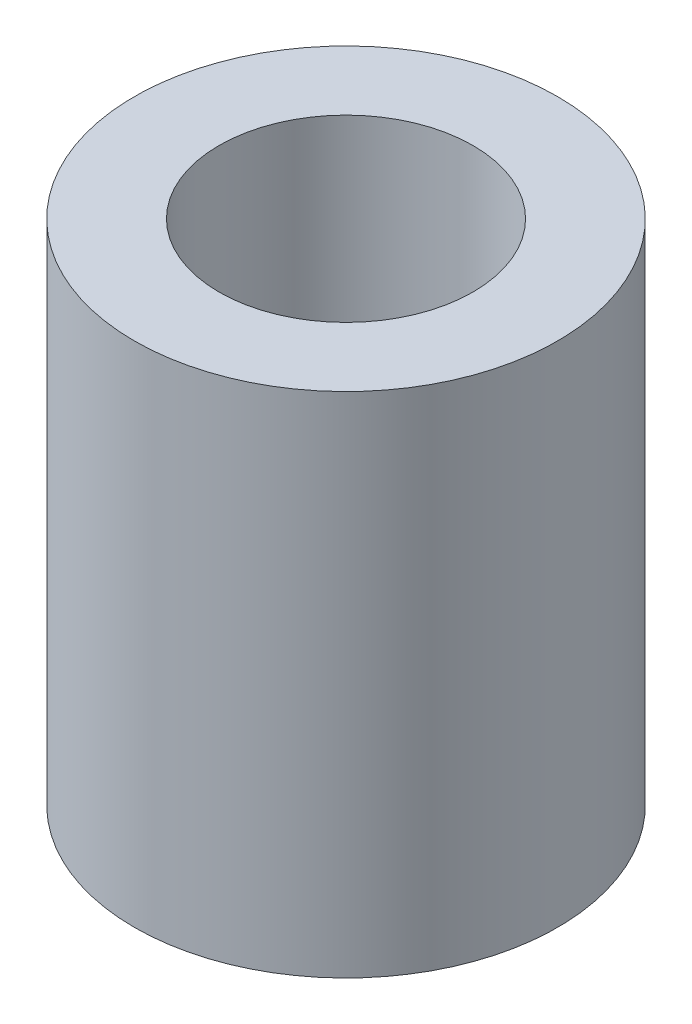
ISO-10303-21;
HEADER;
FILE_DESCRIPTION(('STEP AP214'),'2;1');
FILE_NAME('part.step','',(''),(''),'','','');
FILE_SCHEMA(('AUTOMOTIVE_DESIGN { 1 0 10303 214 1 1 1 1 }'));
ENDSEC;
DATA;
#1=APPLICATION_CONTEXT('core data for automotive mechanical design processes');
#2=APPLICATION_PROTOCOL_DEFINITION('international standard','automotive_design',2000,#1);
#3=PRODUCT_CONTEXT('',#1,'mechanical');
#4=PRODUCT('Part','Part','',(#3));
#5=PRODUCT_RELATED_PRODUCT_CATEGORY('part','',(#4));
#6=PRODUCT_DEFINITION_FORMATION('','',#4);
#7=PRODUCT_DEFINITION_CONTEXT('part definition',#1,'design');
#8=PRODUCT_DEFINITION('design','',#6,#7);
#9=PRODUCT_DEFINITION_SHAPE('','',#8);
#10=(LENGTH_UNIT() NAMED_UNIT(*) SI_UNIT(.MILLI.,.METRE.));
#11=(NAMED_UNIT(*) PLANE_ANGLE_UNIT() SI_UNIT($,.RADIAN.));
#12=(NAMED_UNIT(*) SI_UNIT($,.STERADIAN.) SOLID_ANGLE_UNIT());
#13=UNCERTAINTY_MEASURE_WITH_UNIT(LENGTH_MEASURE(1.E-05),#10,'distance_accuracy_value','');
#14=(GEOMETRIC_REPRESENTATION_CONTEXT(3) GLOBAL_UNCERTAINTY_ASSIGNED_CONTEXT((#13)) GLOBAL_UNIT_ASSIGNED_CONTEXT((#10,
#11,#12)) REPRESENTATION_CONTEXT('',''));
#15=CARTESIAN_POINT('',(0.,0.,0.));
#16=DIRECTION('',(0.,0.,1.));
#17=DIRECTION('',(1.,0.,0.));
#18=AXIS2_PLACEMENT_3D('',#15,#16,#17);
#19=CARTESIAN_POINT('',(0.,18.,0.));
#20=DIRECTION('',(0.,1.,0.));
#21=DIRECTION('',(0.,0.,1.));
#22=AXIS2_PLACEMENT_3D('',#19,#20,#21);
#23=PLANE('',#22);
#24=CARTESIAN_POINT('',(0.,18.,0.));
#25=DIRECTION('',(0.,1.,0.));
#26=DIRECTION('',(0.,0.,1.));
#27=AXIS2_PLACEMENT_3D('',#24,#25,#26);
#28=CIRCLE('',#27,7.5);
#29=CARTESIAN_POINT('',(0.,18.,7.5));
#30=VERTEX_POINT('',#29);
#31=EDGE_CURVE('E10',#30,#30,#28,.T.);
#32=ORIENTED_EDGE('',*,*,#31,.T.);
#33=EDGE_LOOP('',(#32));
#34=FACE_BOUND('',#33,.T.);
#35=CARTESIAN_POINT('',(0.,18.,0.));
#36=DIRECTION('',(0.,1.,0.));
#37=DIRECTION('',(0.,0.,1.));
#38=AXIS2_PLACEMENT_3D('',#35,#36,#37);
#39=CIRCLE('',#38,4.5);
#40=CARTESIAN_POINT('',(0.,18.,4.5));
#41=VERTEX_POINT('',#40);
#42=EDGE_CURVE('E46',#41,#41,#39,.T.);
#43=ORIENTED_EDGE('',*,*,#42,.F.);
#44=EDGE_LOOP('',(#43));
#45=FACE_BOUND('',#44,.T.);
#46=ADVANCED_FACE('F35',(#34,#45),#23,.T.);
#47=CARTESIAN_POINT('',(0.,0.,0.));
#48=DIRECTION('',(0.,1.,0.));
#49=DIRECTION('',(0.,0.,1.));
#50=AXIS2_PLACEMENT_3D('',#47,#48,#49);
#51=PLANE('',#50);
#52=CARTESIAN_POINT('',(0.,0.,0.));
#53=DIRECTION('',(0.,1.,0.));
#54=DIRECTION('',(0.,0.,1.));
#55=AXIS2_PLACEMENT_3D('',#52,#53,#54);
#56=CIRCLE('',#55,7.5);
#57=CARTESIAN_POINT('',(0.,0.,7.5));
#58=VERTEX_POINT('',#57);
#59=EDGE_CURVE('E39',#58,#58,#56,.T.);
#60=ORIENTED_EDGE('',*,*,#59,.F.);
#61=EDGE_LOOP('',(#60));
#62=FACE_BOUND('',#61,.T.);
#63=CARTESIAN_POINT('',(0.,0.,0.));
#64=DIRECTION('',(0.,1.,0.));
#65=DIRECTION('',(0.,0.,1.));
#66=AXIS2_PLACEMENT_3D('',#63,#64,#65);
#67=CIRCLE('',#66,4.5);
#68=CARTESIAN_POINT('',(0.,0.,4.5));
#69=VERTEX_POINT('',#68);
#70=EDGE_CURVE('E48',#69,#69,#67,.T.);
#71=ORIENTED_EDGE('',*,*,#70,.T.);
#72=EDGE_LOOP('',(#71));
#73=FACE_BOUND('',#72,.T.);
#74=ADVANCED_FACE('F58',(#62,#73),#51,.F.);
#75=CARTESIAN_POINT('',(0.,18.,0.));
#76=DIRECTION('',(0.,-1.,0.));
#77=DIRECTION('',(0.,0.,-1.));
#78=AXIS2_PLACEMENT_3D('',#75,#76,#77);
#79=CYLINDRICAL_SURFACE('',#78,7.5);
#80=ORIENTED_EDGE('',*,*,#31,.F.);
#81=EDGE_LOOP('',(#80));
#82=FACE_BOUND('',#81,.T.);
#83=ORIENTED_EDGE('',*,*,#59,.T.);
#84=EDGE_LOOP('',(#83));
#85=FACE_BOUND('',#84,.T.);
#86=ADVANCED_FACE('F37',(#82,#85),#79,.T.);
#87=CARTESIAN_POINT('',(0.,18.,0.));
#88=DIRECTION('',(0.,-1.,0.));
#89=DIRECTION('',(0.,0.,-1.));
#90=AXIS2_PLACEMENT_3D('',#87,#88,#89);
#91=CYLINDRICAL_SURFACE('',#90,4.5);
#92=ORIENTED_EDGE('',*,*,#42,.T.);
#93=EDGE_LOOP('',(#92));
#94=FACE_BOUND('',#93,.T.);
#95=ORIENTED_EDGE('',*,*,#70,.F.);
#96=EDGE_LOOP('',(#95));
#97=FACE_BOUND('',#96,.T.);
#98=ADVANCED_FACE('F54',(#94,#97),#91,.F.);
#99=CLOSED_SHELL('',(#46,#74,#86,#98));
#100=MANIFOLD_SOLID_BREP('B2',#99);
#101=ADVANCED_BREP_SHAPE_REPRESENTATION('',(#18,#100),#14);
#102=SHAPE_DEFINITION_REPRESENTATION(#9,#101);
ENDSEC;
END-ISO-10303-21;
